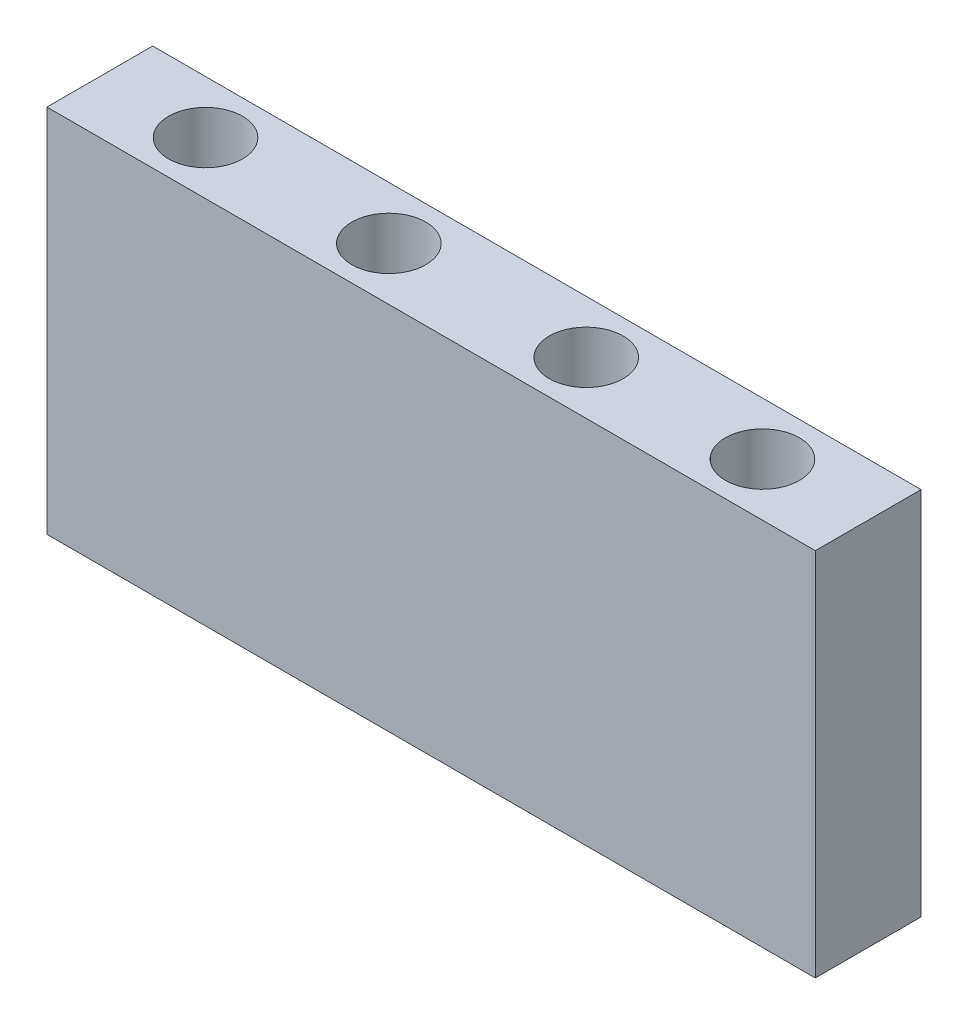
ISO-10303-21;
HEADER;
FILE_DESCRIPTION(('STEP AP214'),'2;1');
FILE_NAME('part.step','',(''),(''),'','','');
FILE_SCHEMA(('AUTOMOTIVE_DESIGN { 1 0 10303 214 1 1 1 1 }'));
ENDSEC;
DATA;
#1=APPLICATION_CONTEXT('core data for automotive mechanical design processes');
#2=APPLICATION_PROTOCOL_DEFINITION('international standard','automotive_design',2000,#1);
#3=PRODUCT_CONTEXT('',#1,'mechanical');
#4=PRODUCT('Part','Part','',(#3));
#5=PRODUCT_RELATED_PRODUCT_CATEGORY('part','',(#4));
#6=PRODUCT_DEFINITION_FORMATION('','',#4);
#7=PRODUCT_DEFINITION_CONTEXT('part definition',#1,'design');
#8=PRODUCT_DEFINITION('design','',#6,#7);
#9=PRODUCT_DEFINITION_SHAPE('','',#8);
#10=(LENGTH_UNIT() NAMED_UNIT(*) SI_UNIT(.MILLI.,.METRE.));
#11=(NAMED_UNIT(*) PLANE_ANGLE_UNIT() SI_UNIT($,.RADIAN.));
#12=(NAMED_UNIT(*) SI_UNIT($,.STERADIAN.) SOLID_ANGLE_UNIT());
#13=UNCERTAINTY_MEASURE_WITH_UNIT(LENGTH_MEASURE(1.E-05),#10,'distance_accuracy_value','');
#14=(GEOMETRIC_REPRESENTATION_CONTEXT(3) GLOBAL_UNCERTAINTY_ASSIGNED_CONTEXT((#13)) GLOBAL_UNIT_ASSIGNED_CONTEXT((#10,
#11,#12)) REPRESENTATION_CONTEXT('',''));
#15=CARTESIAN_POINT('',(0.,0.,0.));
#16=DIRECTION('',(0.,0.,1.));
#17=DIRECTION('',(1.,0.,0.));
#18=AXIS2_PLACEMENT_3D('',#15,#16,#17);
#19=CARTESIAN_POINT('',(0.,0.,30.));
#20=DIRECTION('',(1.,0.,0.));
#21=DIRECTION('',(0.,0.,-1.));
#22=AXIS2_PLACEMENT_3D('',#19,#20,#21);
#23=PLANE('',#22);
#24=DIRECTION('',(0.,-1.,0.));
#25=VECTOR('',#24,1.);
#26=CARTESIAN_POINT('',(0.,0.,0.));
#27=LINE('',#26,#25);
#28=CARTESIAN_POINT('',(0.,105.,0.));
#29=VERTEX_POINT('',#28);
#30=CARTESIAN_POINT('',(0.,0.,0.));
#31=VERTEX_POINT('',#30);
#32=EDGE_CURVE('E95',#29,#31,#27,.T.);
#33=ORIENTED_EDGE('',*,*,#32,.T.);
#34=DIRECTION('',(0.,0.,-1.));
#35=VECTOR('',#34,1.);
#36=CARTESIAN_POINT('',(0.,0.,30.));
#37=LINE('',#36,#35);
#38=CARTESIAN_POINT('',(0.,0.,30.));
#39=VERTEX_POINT('',#38);
#40=EDGE_CURVE('E11',#39,#31,#37,.T.);
#41=ORIENTED_EDGE('',*,*,#40,.F.);
#42=DIRECTION('',(0.,-1.,0.));
#43=VECTOR('',#42,1.);
#44=CARTESIAN_POINT('',(0.,0.,30.));
#45=LINE('',#44,#43);
#46=CARTESIAN_POINT('',(0.,105.,30.));
#47=VERTEX_POINT('',#46);
#48=EDGE_CURVE('E83',#47,#39,#45,.T.);
#49=ORIENTED_EDGE('',*,*,#48,.F.);
#50=DIRECTION('',(0.,0.,-1.));
#51=VECTOR('',#50,1.);
#52=CARTESIAN_POINT('',(0.,105.,30.));
#53=LINE('',#52,#51);
#54=EDGE_CURVE('E91',#47,#29,#53,.T.);
#55=ORIENTED_EDGE('',*,*,#54,.T.);
#56=EDGE_LOOP('',(#33,#41,#49,#55));
#57=FACE_BOUND('',#56,.T.);
#58=ADVANCED_FACE('F32',(#57),#23,.F.);
#59=CARTESIAN_POINT('',(0.,0.,30.));
#60=DIRECTION('',(0.,1.,0.));
#61=DIRECTION('',(0.,0.,1.));
#62=AXIS2_PLACEMENT_3D('',#59,#60,#61);
#63=PLANE('',#62);
#64=CARTESIAN_POINT('',(82.,0.,15.));
#65=DIRECTION('',(0.,1.,0.));
#66=DIRECTION('',(0.,0.,1.));
#67=AXIS2_PLACEMENT_3D('',#64,#65,#66);
#68=CIRCLE('',#67,10.5);
#69=CARTESIAN_POINT('',(82.,0.,25.5));
#70=VERTEX_POINT('',#69);
#71=EDGE_CURVE('E112',#70,#70,#68,.T.);
#72=ORIENTED_EDGE('',*,*,#71,.T.);
#73=EDGE_LOOP('',(#72));
#74=FACE_BOUND('',#73,.T.);
#75=CARTESIAN_POINT('',(138.,0.,15.));
#76=DIRECTION('',(0.,1.,0.));
#77=DIRECTION('',(0.,0.,1.));
#78=AXIS2_PLACEMENT_3D('',#75,#76,#77);
#79=CIRCLE('',#78,10.5);
#80=CARTESIAN_POINT('',(138.,0.,25.5));
#81=VERTEX_POINT('',#80);
#82=EDGE_CURVE('E124',#81,#81,#79,.T.);
#83=ORIENTED_EDGE('',*,*,#82,.T.);
#84=EDGE_LOOP('',(#83));
#85=FACE_BOUND('',#84,.T.);
#86=CARTESIAN_POINT('',(188.,0.,15.));
#87=DIRECTION('',(0.,1.,0.));
#88=DIRECTION('',(0.,0.,1.));
#89=AXIS2_PLACEMENT_3D('',#86,#87,#88);
#90=CIRCLE('',#89,10.5);
#91=CARTESIAN_POINT('',(188.,0.,25.5));
#92=VERTEX_POINT('',#91);
#93=EDGE_CURVE('E118',#92,#92,#90,.T.);
#94=ORIENTED_EDGE('',*,*,#93,.T.);
#95=EDGE_LOOP('',(#94));
#96=FACE_BOUND('',#95,.T.);
#97=CARTESIAN_POINT('',(30.,0.,15.));
#98=DIRECTION('',(0.,1.,0.));
#99=DIRECTION('',(0.,0.,1.));
#100=AXIS2_PLACEMENT_3D('',#97,#98,#99);
#101=CIRCLE('',#100,10.5);
#102=CARTESIAN_POINT('',(30.,0.,25.5));
#103=VERTEX_POINT('',#102);
#104=EDGE_CURVE('E98',#103,#103,#101,.T.);
#105=ORIENTED_EDGE('',*,*,#104,.T.);
#106=EDGE_LOOP('',(#105));
#107=FACE_BOUND('',#106,.T.);
#108=DIRECTION('',(1.,0.,0.));
#109=VECTOR('',#108,1.);
#110=CARTESIAN_POINT('',(0.,0.,0.));
#111=LINE('',#110,#109);
#112=CARTESIAN_POINT('',(218.,0.,0.));
#113=VERTEX_POINT('',#112);
#114=EDGE_CURVE('E87',#31,#113,#111,.T.);
#115=ORIENTED_EDGE('',*,*,#114,.T.);
#116=DIRECTION('',(0.,0.,-1.));
#117=VECTOR('',#116,1.);
#118=CARTESIAN_POINT('',(218.,0.,30.));
#119=LINE('',#118,#117);
#120=CARTESIAN_POINT('',(218.,0.,30.));
#121=VERTEX_POINT('',#120);
#122=EDGE_CURVE('E40',#121,#113,#119,.T.);
#123=ORIENTED_EDGE('',*,*,#122,.F.);
#124=DIRECTION('',(1.,0.,0.));
#125=VECTOR('',#124,1.);
#126=CARTESIAN_POINT('',(0.,0.,30.));
#127=LINE('',#126,#125);
#128=EDGE_CURVE('E78',#39,#121,#127,.T.);
#129=ORIENTED_EDGE('',*,*,#128,.F.);
#130=ORIENTED_EDGE('',*,*,#40,.T.);
#131=EDGE_LOOP('',(#115,#123,#129,#130));
#132=FACE_BOUND('',#131,.T.);
#133=ADVANCED_FACE('F86',(#74,#85,#96,#107,#132),#63,.F.);
#134=CARTESIAN_POINT('',(218.,0.,30.));
#135=DIRECTION('',(-1.,0.,0.));
#136=DIRECTION('',(0.,0.,1.));
#137=AXIS2_PLACEMENT_3D('',#134,#135,#136);
#138=PLANE('',#137);
#139=DIRECTION('',(0.,1.,0.));
#140=VECTOR('',#139,1.);
#141=CARTESIAN_POINT('',(218.,0.,0.));
#142=LINE('',#141,#140);
#143=CARTESIAN_POINT('',(218.,105.,0.));
#144=VERTEX_POINT('',#143);
#145=EDGE_CURVE('E65',#113,#144,#142,.T.);
#146=ORIENTED_EDGE('',*,*,#145,.T.);
#147=DIRECTION('',(0.,0.,-1.));
#148=VECTOR('',#147,1.);
#149=CARTESIAN_POINT('',(218.,105.,30.));
#150=LINE('',#149,#148);
#151=CARTESIAN_POINT('',(218.,105.,30.));
#152=VERTEX_POINT('',#151);
#153=EDGE_CURVE('E88',#152,#144,#150,.T.);
#154=ORIENTED_EDGE('',*,*,#153,.F.);
#155=DIRECTION('',(0.,1.,0.));
#156=VECTOR('',#155,1.);
#157=CARTESIAN_POINT('',(218.,0.,30.));
#158=LINE('',#157,#156);
#159=EDGE_CURVE('E81',#121,#152,#158,.T.);
#160=ORIENTED_EDGE('',*,*,#159,.F.);
#161=ORIENTED_EDGE('',*,*,#122,.T.);
#162=EDGE_LOOP('',(#146,#154,#160,#161));
#163=FACE_BOUND('',#162,.T.);
#164=ADVANCED_FACE('F89',(#163),#138,.F.);
#165=CARTESIAN_POINT('',(0.,105.,30.));
#166=DIRECTION('',(0.,-1.,0.));
#167=DIRECTION('',(0.,0.,-1.));
#168=AXIS2_PLACEMENT_3D('',#165,#166,#167);
#169=PLANE('',#168);
#170=CARTESIAN_POINT('',(82.,105.,15.));
#171=DIRECTION('',(0.,1.,0.));
#172=DIRECTION('',(0.,0.,1.));
#173=AXIS2_PLACEMENT_3D('',#170,#171,#172);
#174=CIRCLE('',#173,10.5);
#175=CARTESIAN_POINT('',(82.,105.,25.5));
#176=VERTEX_POINT('',#175);
#177=EDGE_CURVE('E127',#176,#176,#174,.T.);
#178=ORIENTED_EDGE('',*,*,#177,.F.);
#179=EDGE_LOOP('',(#178));
#180=FACE_BOUND('',#179,.T.);
#181=CARTESIAN_POINT('',(138.,105.,15.));
#182=DIRECTION('',(0.,1.,0.));
#183=DIRECTION('',(0.,0.,1.));
#184=AXIS2_PLACEMENT_3D('',#181,#182,#183);
#185=CIRCLE('',#184,10.5);
#186=CARTESIAN_POINT('',(138.,105.,25.5));
#187=VERTEX_POINT('',#186);
#188=EDGE_CURVE('E121',#187,#187,#185,.T.);
#189=ORIENTED_EDGE('',*,*,#188,.F.);
#190=EDGE_LOOP('',(#189));
#191=FACE_BOUND('',#190,.T.);
#192=CARTESIAN_POINT('',(188.,105.,15.));
#193=DIRECTION('',(0.,1.,0.));
#194=DIRECTION('',(0.,0.,1.));
#195=AXIS2_PLACEMENT_3D('',#192,#193,#194);
#196=CIRCLE('',#195,10.5);
#197=CARTESIAN_POINT('',(188.,105.,25.5));
#198=VERTEX_POINT('',#197);
#199=EDGE_CURVE('E115',#198,#198,#196,.T.);
#200=ORIENTED_EDGE('',*,*,#199,.F.);
#201=EDGE_LOOP('',(#200));
#202=FACE_BOUND('',#201,.T.);
#203=CARTESIAN_POINT('',(30.,105.,15.));
#204=DIRECTION('',(0.,1.,0.));
#205=DIRECTION('',(0.,0.,1.));
#206=AXIS2_PLACEMENT_3D('',#203,#204,#205);
#207=CIRCLE('',#206,10.5);
#208=CARTESIAN_POINT('',(30.,105.,25.5));
#209=VERTEX_POINT('',#208);
#210=EDGE_CURVE('E109',#209,#209,#207,.T.);
#211=ORIENTED_EDGE('',*,*,#210,.F.);
#212=EDGE_LOOP('',(#211));
#213=FACE_BOUND('',#212,.T.);
#214=DIRECTION('',(-1.,0.,0.));
#215=VECTOR('',#214,1.);
#216=CARTESIAN_POINT('',(0.,105.,0.));
#217=LINE('',#216,#215);
#218=EDGE_CURVE('E71',#144,#29,#217,.T.);
#219=ORIENTED_EDGE('',*,*,#218,.T.);
#220=ORIENTED_EDGE('',*,*,#54,.F.);
#221=DIRECTION('',(-1.,0.,0.));
#222=VECTOR('',#221,1.);
#223=CARTESIAN_POINT('',(0.,105.,30.));
#224=LINE('',#223,#222);
#225=EDGE_CURVE('E48',#152,#47,#224,.T.);
#226=ORIENTED_EDGE('',*,*,#225,.F.);
#227=ORIENTED_EDGE('',*,*,#153,.T.);
#228=EDGE_LOOP('',(#219,#220,#226,#227));
#229=FACE_BOUND('',#228,.T.);
#230=ADVANCED_FACE('F103',(#180,#191,#202,#213,#229),#169,.F.);
#231=CARTESIAN_POINT('',(0.,0.,30.));
#232=DIRECTION('',(0.,0.,-1.));
#233=DIRECTION('',(-1.,0.,0.));
#234=AXIS2_PLACEMENT_3D('',#231,#232,#233);
#235=PLANE('',#234);
#236=ORIENTED_EDGE('',*,*,#48,.T.);
#237=ORIENTED_EDGE('',*,*,#128,.T.);
#238=ORIENTED_EDGE('',*,*,#159,.T.);
#239=ORIENTED_EDGE('',*,*,#225,.T.);
#240=EDGE_LOOP('',(#236,#237,#238,#239));
#241=FACE_BOUND('',#240,.T.);
#242=ADVANCED_FACE('F79',(#241),#235,.F.);
#243=CARTESIAN_POINT('',(0.,0.,0.));
#244=DIRECTION('',(0.,0.,-1.));
#245=DIRECTION('',(-1.,0.,0.));
#246=AXIS2_PLACEMENT_3D('',#243,#244,#245);
#247=PLANE('',#246);
#248=ORIENTED_EDGE('',*,*,#32,.F.);
#249=ORIENTED_EDGE('',*,*,#218,.F.);
#250=ORIENTED_EDGE('',*,*,#145,.F.);
#251=ORIENTED_EDGE('',*,*,#114,.F.);
#252=EDGE_LOOP('',(#248,#249,#250,#251));
#253=FACE_BOUND('',#252,.T.);
#254=ADVANCED_FACE('F106',(#253),#247,.T.);
#255=CARTESIAN_POINT('',(30.,0.,15.));
#256=DIRECTION('',(0.,1.,0.));
#257=DIRECTION('',(0.,0.,1.));
#258=AXIS2_PLACEMENT_3D('',#255,#256,#257);
#259=CYLINDRICAL_SURFACE('',#258,10.5);
#260=ORIENTED_EDGE('',*,*,#104,.F.);
#261=EDGE_LOOP('',(#260));
#262=FACE_BOUND('',#261,.T.);
#263=ORIENTED_EDGE('',*,*,#210,.T.);
#264=EDGE_LOOP('',(#263));
#265=FACE_BOUND('',#264,.T.);
#266=ADVANCED_FACE('F151',(#262,#265),#259,.F.);
#267=CARTESIAN_POINT('',(188.,0.,15.));
#268=DIRECTION('',(0.,1.,0.));
#269=DIRECTION('',(0.,0.,1.));
#270=AXIS2_PLACEMENT_3D('',#267,#268,#269);
#271=CYLINDRICAL_SURFACE('',#270,10.5);
#272=ORIENTED_EDGE('',*,*,#93,.F.);
#273=EDGE_LOOP('',(#272));
#274=FACE_BOUND('',#273,.T.);
#275=ORIENTED_EDGE('',*,*,#199,.T.);
#276=EDGE_LOOP('',(#275));
#277=FACE_BOUND('',#276,.T.);
#278=ADVANCED_FACE('F153',(#274,#277),#271,.F.);
#279=CARTESIAN_POINT('',(138.,0.,15.));
#280=DIRECTION('',(0.,1.,0.));
#281=DIRECTION('',(0.,0.,1.));
#282=AXIS2_PLACEMENT_3D('',#279,#280,#281);
#283=CYLINDRICAL_SURFACE('',#282,10.5);
#284=ORIENTED_EDGE('',*,*,#82,.F.);
#285=EDGE_LOOP('',(#284));
#286=FACE_BOUND('',#285,.T.);
#287=ORIENTED_EDGE('',*,*,#188,.T.);
#288=EDGE_LOOP('',(#287));
#289=FACE_BOUND('',#288,.T.);
#290=ADVANCED_FACE('F138',(#286,#289),#283,.F.);
#291=CARTESIAN_POINT('',(82.,0.,15.));
#292=DIRECTION('',(0.,1.,0.));
#293=DIRECTION('',(0.,0.,1.));
#294=AXIS2_PLACEMENT_3D('',#291,#292,#293);
#295=CYLINDRICAL_SURFACE('',#294,10.5);
#296=ORIENTED_EDGE('',*,*,#71,.F.);
#297=EDGE_LOOP('',(#296));
#298=FACE_BOUND('',#297,.T.);
#299=ORIENTED_EDGE('',*,*,#177,.T.);
#300=EDGE_LOOP('',(#299));
#301=FACE_BOUND('',#300,.T.);
#302=ADVANCED_FACE('F135',(#298,#301),#295,.F.);
#303=CLOSED_SHELL('',(#58,#133,#164,#230,#242,#254,#266,#278,#290,#302));
#304=MANIFOLD_SOLID_BREP('B2',#303);
#305=ADVANCED_BREP_SHAPE_REPRESENTATION('',(#18,#304),#14);
#306=SHAPE_DEFINITION_REPRESENTATION(#9,#305);
ENDSEC;
END-ISO-10303-21;
